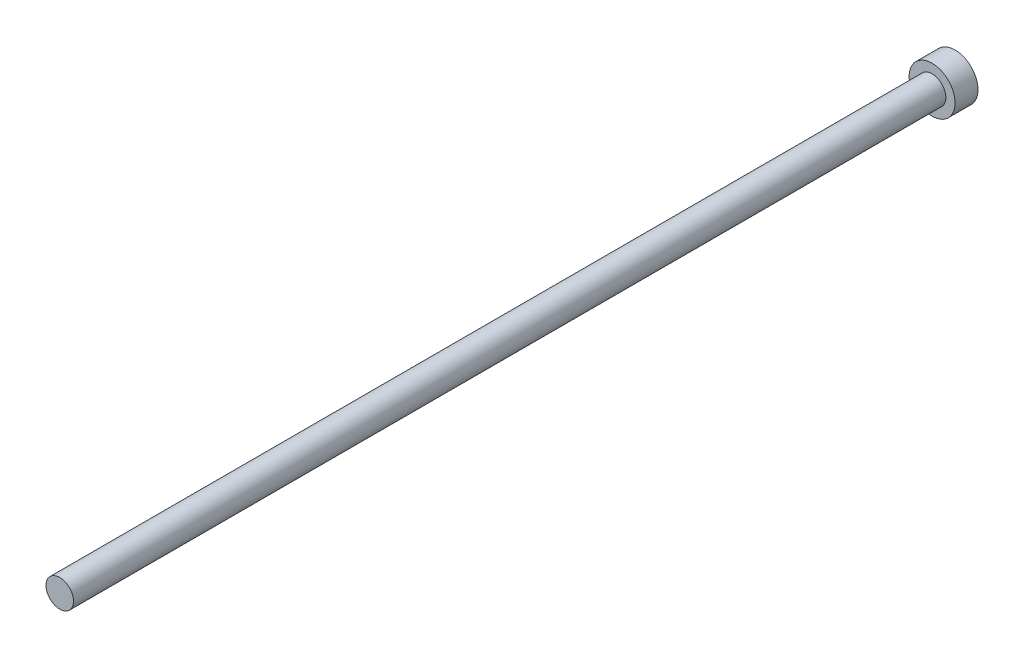
ISO-10303-21;
HEADER;
FILE_DESCRIPTION(('STEP AP214'),'2;1');
FILE_NAME('part.step','',(''),(''),'','','');
FILE_SCHEMA(('AUTOMOTIVE_DESIGN { 1 0 10303 214 1 1 1 1 }'));
ENDSEC;
DATA;
#1=APPLICATION_CONTEXT('core data for automotive mechanical design processes');
#2=APPLICATION_PROTOCOL_DEFINITION('international standard','automotive_design',2000,#1);
#3=PRODUCT_CONTEXT('',#1,'mechanical');
#4=PRODUCT('Part','Part','',(#3));
#5=PRODUCT_RELATED_PRODUCT_CATEGORY('part','',(#4));
#6=PRODUCT_DEFINITION_FORMATION('','',#4);
#7=PRODUCT_DEFINITION_CONTEXT('part definition',#1,'design');
#8=PRODUCT_DEFINITION('design','',#6,#7);
#9=PRODUCT_DEFINITION_SHAPE('','',#8);
#10=(LENGTH_UNIT() NAMED_UNIT(*) SI_UNIT(.MILLI.,.METRE.));
#11=(NAMED_UNIT(*) PLANE_ANGLE_UNIT() SI_UNIT($,.RADIAN.));
#12=(NAMED_UNIT(*) SI_UNIT($,.STERADIAN.) SOLID_ANGLE_UNIT());
#13=UNCERTAINTY_MEASURE_WITH_UNIT(LENGTH_MEASURE(1.E-05),#10,'distance_accuracy_value','');
#14=(GEOMETRIC_REPRESENTATION_CONTEXT(3) GLOBAL_UNCERTAINTY_ASSIGNED_CONTEXT((#13)) GLOBAL_UNIT_ASSIGNED_CONTEXT((#10,
#11,#12)) REPRESENTATION_CONTEXT('',''));
#15=CARTESIAN_POINT('',(0.,0.,0.));
#16=DIRECTION('',(0.,0.,1.));
#17=DIRECTION('',(1.,0.,0.));
#18=AXIS2_PLACEMENT_3D('',#15,#16,#17);
#19=CARTESIAN_POINT('',(0.,0.,5.));
#20=DIRECTION('',(0.,0.,1.));
#21=DIRECTION('',(1.,0.,0.));
#22=AXIS2_PLACEMENT_3D('',#19,#20,#21);
#23=PLANE('',#22);
#24=CARTESIAN_POINT('',(0.,0.,5.));
#25=DIRECTION('',(0.,0.,1.));
#26=DIRECTION('',(1.,0.,0.));
#27=AXIS2_PLACEMENT_3D('',#24,#25,#26);
#28=CIRCLE('',#27,5.);
#29=CARTESIAN_POINT('',(5.,0.,5.));
#30=VERTEX_POINT('',#29);
#31=EDGE_CURVE('E11',#30,#30,#28,.T.);
#32=ORIENTED_EDGE('',*,*,#31,.T.);
#33=EDGE_LOOP('',(#32));
#34=FACE_BOUND('',#33,.T.);
#35=CARTESIAN_POINT('',(0.,0.,5.));
#36=DIRECTION('',(0.,0.,1.));
#37=DIRECTION('',(1.,0.,0.));
#38=AXIS2_PLACEMENT_3D('',#35,#36,#37);
#39=CIRCLE('',#38,3.);
#40=CARTESIAN_POINT('',(3.,0.,5.));
#41=VERTEX_POINT('',#40);
#42=EDGE_CURVE('E152',#41,#41,#39,.T.);
#43=ORIENTED_EDGE('',*,*,#42,.F.);
#44=EDGE_LOOP('',(#43));
#45=FACE_BOUND('',#44,.T.);
#46=ADVANCED_FACE('F33',(#34,#45),#23,.T.);
#47=CARTESIAN_POINT('',(0.,0.,5.));
#48=DIRECTION('',(0.,0.,-1.));
#49=DIRECTION('',(-1.,0.,0.));
#50=AXIS2_PLACEMENT_3D('',#47,#48,#49);
#51=CYLINDRICAL_SURFACE('',#50,5.);
#52=ORIENTED_EDGE('',*,*,#31,.F.);
#53=EDGE_LOOP('',(#52));
#54=FACE_BOUND('',#53,.T.);
#55=CARTESIAN_POINT('',(0.,0.,0.));
#56=DIRECTION('',(0.,0.,1.));
#57=DIRECTION('',(1.,0.,0.));
#58=AXIS2_PLACEMENT_3D('',#55,#56,#57);
#59=CIRCLE('',#58,5.);
#60=CARTESIAN_POINT('',(5.,0.,0.));
#61=VERTEX_POINT('',#60);
#62=EDGE_CURVE('E37',#61,#61,#59,.T.);
#63=ORIENTED_EDGE('',*,*,#62,.T.);
#64=EDGE_LOOP('',(#63));
#65=FACE_BOUND('',#64,.T.);
#66=ADVANCED_FACE('F35',(#54,#65),#51,.T.);
#67=CARTESIAN_POINT('',(0.,0.,0.));
#68=DIRECTION('',(0.,0.,1.));
#69=DIRECTION('',(1.,0.,0.));
#70=AXIS2_PLACEMENT_3D('',#67,#68,#69);
#71=PLANE('',#70);
#72=DIRECTION('',(0.00800673288464227,-0.999967945600515,0.));
#73=VECTOR('',#72,1.);
#74=CARTESIAN_POINT('',(3.22912636764274,1.89897119404489,0.));
#75=LINE('',#74,#73);
#76=CARTESIAN_POINT('',(3.22912636764273,1.89897119404489,0.));
#77=VERTEX_POINT('',#76);
#78=CARTESIAN_POINT('',(3.25912047891911,-1.84701986938633,0.));
#79=VERTEX_POINT('',#78);
#80=EDGE_CURVE('E122',#77,#79,#75,.T.);
#81=ORIENTED_EDGE('',*,*,#80,.F.);
#82=DIRECTION('',(0.870001010302503,-0.49304993872084,0.));
#83=VECTOR('',#82,1.);
#84=CARTESIAN_POINT('',(-0.0299941112763781,3.74599106343122,0.));
#85=LINE('',#84,#83);
#86=CARTESIAN_POINT('',(-0.0299941112763781,3.74599106343122,0.));
#87=VERTEX_POINT('',#86);
#88=EDGE_CURVE('E48',#87,#77,#85,.T.);
#89=ORIENTED_EDGE('',*,*,#88,.F.);
#90=DIRECTION('',(0.86199427741786,0.506918006879674,0.));
#91=VECTOR('',#90,1.);
#92=CARTESIAN_POINT('',(-3.25912047891911,1.84701986938633,0.));
#93=LINE('',#92,#91);
#94=CARTESIAN_POINT('',(-3.25912047891911,1.84701986938633,0.));
#95=VERTEX_POINT('',#94);
#96=EDGE_CURVE('E132',#95,#87,#93,.T.);
#97=ORIENTED_EDGE('',*,*,#96,.F.);
#98=DIRECTION('',(-0.0080067328846425,0.999967945600515,0.));
#99=VECTOR('',#98,1.);
#100=CARTESIAN_POINT('',(-3.22912636764274,-1.89897119404489,0.));
#101=LINE('',#100,#99);
#102=CARTESIAN_POINT('',(-3.22912636764274,-1.89897119404489,0.));
#103=VERTEX_POINT('',#102);
#104=EDGE_CURVE('E130',#103,#95,#101,.T.);
#105=ORIENTED_EDGE('',*,*,#104,.F.);
#106=DIRECTION('',(-0.870001010302503,0.493049938720841,0.));
#107=VECTOR('',#106,1.);
#108=CARTESIAN_POINT('',(0.0299941112763753,-3.74599106343122,0.));
#109=LINE('',#108,#107);
#110=CARTESIAN_POINT('',(0.0299941112763753,-3.74599106343122,0.));
#111=VERTEX_POINT('',#110);
#112=EDGE_CURVE('E96',#111,#103,#109,.T.);
#113=ORIENTED_EDGE('',*,*,#112,.F.);
#114=DIRECTION('',(-0.86199427741786,-0.506918006879674,0.));
#115=VECTOR('',#114,1.);
#116=CARTESIAN_POINT('',(3.25912047891911,-1.84701986938633,0.));
#117=LINE('',#116,#115);
#118=EDGE_CURVE('E126',#79,#111,#117,.T.);
#119=ORIENTED_EDGE('',*,*,#118,.F.);
#120=EDGE_LOOP('',(#81,#89,#97,#105,#113,#119));
#121=FACE_BOUND('',#120,.T.);
#122=ORIENTED_EDGE('',*,*,#62,.F.);
#123=EDGE_LOOP('',(#122));
#124=FACE_BOUND('',#123,.T.);
#125=ADVANCED_FACE('F145',(#121,#124),#71,.F.);
#126=CARTESIAN_POINT('',(-0.0299941112763781,3.74599106343122,3.));
#127=DIRECTION('',(0.49304993872084,0.870001010302503,0.));
#128=DIRECTION('',(-0.870001010302503,0.49304993872084,0.));
#129=AXIS2_PLACEMENT_3D('',#126,#127,#128);
#130=PLANE('',#129);
#131=ORIENTED_EDGE('',*,*,#88,.T.);
#132=DIRECTION('',(0.,0.,-1.));
#133=VECTOR('',#132,1.);
#134=CARTESIAN_POINT('',(3.22912636764274,1.89897119404489,3.));
#135=LINE('',#134,#133);
#136=CARTESIAN_POINT('',(3.22912636764274,1.89897119404489,3.));
#137=VERTEX_POINT('',#136);
#138=EDGE_CURVE('E78',#137,#77,#135,.T.);
#139=ORIENTED_EDGE('',*,*,#138,.F.);
#140=DIRECTION('',(0.870001010302503,-0.49304993872084,0.));
#141=VECTOR('',#140,1.);
#142=CARTESIAN_POINT('',(-0.0299941112763781,3.74599106343122,3.));
#143=LINE('',#142,#141);
#144=CARTESIAN_POINT('',(-0.0299941112763781,3.74599106343122,3.));
#145=VERTEX_POINT('',#144);
#146=EDGE_CURVE('E134',#145,#137,#143,.T.);
#147=ORIENTED_EDGE('',*,*,#146,.F.);
#148=DIRECTION('',(0.,0.,-1.));
#149=VECTOR('',#148,1.);
#150=CARTESIAN_POINT('',(-0.0299941112763781,3.74599106343122,3.));
#151=LINE('',#150,#149);
#152=EDGE_CURVE('E56',#145,#87,#151,.T.);
#153=ORIENTED_EDGE('',*,*,#152,.T.);
#154=EDGE_LOOP('',(#131,#139,#147,#153));
#155=FACE_BOUND('',#154,.T.);
#156=ADVANCED_FACE('F174',(#155),#130,.F.);
#157=CARTESIAN_POINT('',(-3.25912047891911,1.84701986938633,3.));
#158=DIRECTION('',(-0.506918006879674,0.86199427741786,0.));
#159=DIRECTION('',(-0.86199427741786,-0.506918006879674,0.));
#160=AXIS2_PLACEMENT_3D('',#157,#158,#159);
#161=PLANE('',#160);
#162=ORIENTED_EDGE('',*,*,#96,.T.);
#163=ORIENTED_EDGE('',*,*,#152,.F.);
#164=DIRECTION('',(0.86199427741786,0.506918006879674,0.));
#165=VECTOR('',#164,1.);
#166=CARTESIAN_POINT('',(-3.25912047891911,1.84701986938633,3.));
#167=LINE('',#166,#165);
#168=CARTESIAN_POINT('',(-3.25912047891911,1.84701986938633,3.));
#169=VERTEX_POINT('',#168);
#170=EDGE_CURVE('E108',#169,#145,#167,.T.);
#171=ORIENTED_EDGE('',*,*,#170,.F.);
#172=DIRECTION('',(0.,0.,-1.));
#173=VECTOR('',#172,1.);
#174=CARTESIAN_POINT('',(-3.25912047891911,1.84701986938633,3.));
#175=LINE('',#174,#173);
#176=EDGE_CURVE('E100',#169,#95,#175,.T.);
#177=ORIENTED_EDGE('',*,*,#176,.T.);
#178=EDGE_LOOP('',(#162,#163,#171,#177));
#179=FACE_BOUND('',#178,.T.);
#180=ADVANCED_FACE('F180',(#179),#161,.F.);
#181=CARTESIAN_POINT('',(-3.22912636764274,-1.89897119404489,3.));
#182=DIRECTION('',(-0.999967945600515,-0.0080067328846425,0.));
#183=DIRECTION('',(0.0080067328846425,-0.999967945600515,0.));
#184=AXIS2_PLACEMENT_3D('',#181,#182,#183);
#185=PLANE('',#184);
#186=ORIENTED_EDGE('',*,*,#104,.T.);
#187=ORIENTED_EDGE('',*,*,#176,.F.);
#188=DIRECTION('',(-0.0080067328846425,0.999967945600515,0.));
#189=VECTOR('',#188,1.);
#190=CARTESIAN_POINT('',(-3.22912636764274,-1.89897119404489,3.));
#191=LINE('',#190,#189);
#192=CARTESIAN_POINT('',(-3.22912636764274,-1.89897119404489,3.));
#193=VERTEX_POINT('',#192);
#194=EDGE_CURVE('E104',#193,#169,#191,.T.);
#195=ORIENTED_EDGE('',*,*,#194,.F.);
#196=DIRECTION('',(0.,0.,-1.));
#197=VECTOR('',#196,1.);
#198=CARTESIAN_POINT('',(-3.22912636764274,-1.89897119404489,3.));
#199=LINE('',#198,#197);
#200=EDGE_CURVE('E89',#193,#103,#199,.T.);
#201=ORIENTED_EDGE('',*,*,#200,.T.);
#202=EDGE_LOOP('',(#186,#187,#195,#201));
#203=FACE_BOUND('',#202,.T.);
#204=ADVANCED_FACE('F105',(#203),#185,.F.);
#205=CARTESIAN_POINT('',(0.0299941112763753,-3.74599106343122,3.));
#206=DIRECTION('',(-0.49304993872084,-0.870001010302503,0.));
#207=DIRECTION('',(0.870001010302503,-0.493049938720841,0.));
#208=AXIS2_PLACEMENT_3D('',#205,#206,#207);
#209=PLANE('',#208);
#210=ORIENTED_EDGE('',*,*,#112,.T.);
#211=ORIENTED_EDGE('',*,*,#200,.F.);
#212=DIRECTION('',(-0.870001010302503,0.493049938720841,0.));
#213=VECTOR('',#212,1.);
#214=CARTESIAN_POINT('',(0.0299941112763753,-3.74599106343122,3.));
#215=LINE('',#214,#213);
#216=CARTESIAN_POINT('',(0.0299941112763753,-3.74599106343122,3.));
#217=VERTEX_POINT('',#216);
#218=EDGE_CURVE('E93',#217,#193,#215,.T.);
#219=ORIENTED_EDGE('',*,*,#218,.F.);
#220=DIRECTION('',(0.,0.,-1.));
#221=VECTOR('',#220,1.);
#222=CARTESIAN_POINT('',(0.0299941112763753,-3.74599106343122,3.));
#223=LINE('',#222,#221);
#224=EDGE_CURVE('E101',#217,#111,#223,.T.);
#225=ORIENTED_EDGE('',*,*,#224,.T.);
#226=EDGE_LOOP('',(#210,#211,#219,#225));
#227=FACE_BOUND('',#226,.T.);
#228=ADVANCED_FACE('F91',(#227),#209,.F.);
#229=CARTESIAN_POINT('',(3.25912047891911,-1.84701986938633,3.));
#230=DIRECTION('',(0.506918006879674,-0.86199427741786,0.));
#231=DIRECTION('',(0.86199427741786,0.506918006879674,0.));
#232=AXIS2_PLACEMENT_3D('',#229,#230,#231);
#233=PLANE('',#232);
#234=ORIENTED_EDGE('',*,*,#118,.T.);
#235=ORIENTED_EDGE('',*,*,#224,.F.);
#236=DIRECTION('',(-0.86199427741786,-0.506918006879674,0.));
#237=VECTOR('',#236,1.);
#238=CARTESIAN_POINT('',(3.25912047891911,-1.84701986938633,3.));
#239=LINE('',#238,#237);
#240=CARTESIAN_POINT('',(3.25912047891911,-1.84701986938633,3.));
#241=VERTEX_POINT('',#240);
#242=EDGE_CURVE('E114',#241,#217,#239,.T.);
#243=ORIENTED_EDGE('',*,*,#242,.F.);
#244=DIRECTION('',(0.,0.,-1.));
#245=VECTOR('',#244,1.);
#246=CARTESIAN_POINT('',(3.25912047891911,-1.84701986938633,3.));
#247=LINE('',#246,#245);
#248=EDGE_CURVE('E138',#241,#79,#247,.T.);
#249=ORIENTED_EDGE('',*,*,#248,.T.);
#250=EDGE_LOOP('',(#234,#235,#243,#249));
#251=FACE_BOUND('',#250,.T.);
#252=ADVANCED_FACE('F149',(#251),#233,.F.);
#253=CARTESIAN_POINT('',(3.22912636764274,1.89897119404489,3.));
#254=DIRECTION('',(0.999967945600515,0.00800673288464227,0.));
#255=DIRECTION('',(-0.00800673288464227,0.999967945600515,0.));
#256=AXIS2_PLACEMENT_3D('',#253,#254,#255);
#257=PLANE('',#256);
#258=ORIENTED_EDGE('',*,*,#80,.T.);
#259=ORIENTED_EDGE('',*,*,#248,.F.);
#260=DIRECTION('',(0.00800673288464227,-0.999967945600515,0.));
#261=VECTOR('',#260,1.);
#262=CARTESIAN_POINT('',(3.22912636764274,1.89897119404489,3.));
#263=LINE('',#262,#261);
#264=EDGE_CURVE('E116',#137,#241,#263,.T.);
#265=ORIENTED_EDGE('',*,*,#264,.F.);
#266=ORIENTED_EDGE('',*,*,#138,.T.);
#267=EDGE_LOOP('',(#258,#259,#265,#266));
#268=FACE_BOUND('',#267,.T.);
#269=ADVANCED_FACE('F142',(#268),#257,.F.);
#270=CARTESIAN_POINT('',(0.,0.,3.));
#271=DIRECTION('',(0.,0.,-1.));
#272=DIRECTION('',(-1.,0.,0.));
#273=AXIS2_PLACEMENT_3D('',#270,#271,#272);
#274=PLANE('',#273);
#275=ORIENTED_EDGE('',*,*,#146,.T.);
#276=ORIENTED_EDGE('',*,*,#264,.T.);
#277=ORIENTED_EDGE('',*,*,#242,.T.);
#278=ORIENTED_EDGE('',*,*,#218,.T.);
#279=ORIENTED_EDGE('',*,*,#194,.T.);
#280=ORIENTED_EDGE('',*,*,#170,.T.);
#281=EDGE_LOOP('',(#275,#276,#277,#278,#279,#280));
#282=FACE_BOUND('',#281,.T.);
#283=ADVANCED_FACE('F111',(#282),#274,.T.);
#284=CARTESIAN_POINT('',(0.,0.,195.));
#285=DIRECTION('',(0.,0.,-1.));
#286=DIRECTION('',(-1.,0.,0.));
#287=AXIS2_PLACEMENT_3D('',#284,#285,#286);
#288=CYLINDRICAL_SURFACE('',#287,3.);
#289=CARTESIAN_POINT('',(0.,0.,195.));
#290=DIRECTION('',(0.,0.,1.));
#291=DIRECTION('',(1.,0.,0.));
#292=AXIS2_PLACEMENT_3D('',#289,#290,#291);
#293=CIRCLE('',#292,3.);
#294=CARTESIAN_POINT('',(3.,0.,195.));
#295=VERTEX_POINT('',#294);
#296=EDGE_CURVE('E123',#295,#295,#293,.T.);
#297=ORIENTED_EDGE('',*,*,#296,.F.);
#298=EDGE_LOOP('',(#297));
#299=FACE_BOUND('',#298,.T.);
#300=ORIENTED_EDGE('',*,*,#42,.T.);
#301=EDGE_LOOP('',(#300));
#302=FACE_BOUND('',#301,.T.);
#303=ADVANCED_FACE('F160',(#299,#302),#288,.T.);
#304=CARTESIAN_POINT('',(0.,0.,195.));
#305=DIRECTION('',(0.,0.,1.));
#306=DIRECTION('',(1.,0.,0.));
#307=AXIS2_PLACEMENT_3D('',#304,#305,#306);
#308=PLANE('',#307);
#309=ORIENTED_EDGE('',*,*,#296,.T.);
#310=EDGE_LOOP('',(#309));
#311=FACE_BOUND('',#310,.T.);
#312=ADVANCED_FACE('F158',(#311),#308,.T.);
#313=CLOSED_SHELL('',(#46,#66,#125,#156,#180,#204,#228,#252,#269,#283,#303,#312));
#314=MANIFOLD_SOLID_BREP('B2',#313);
#315=ADVANCED_BREP_SHAPE_REPRESENTATION('',(#18,#314),#14);
#316=SHAPE_DEFINITION_REPRESENTATION(#9,#315);
ENDSEC;
END-ISO-10303-21;
